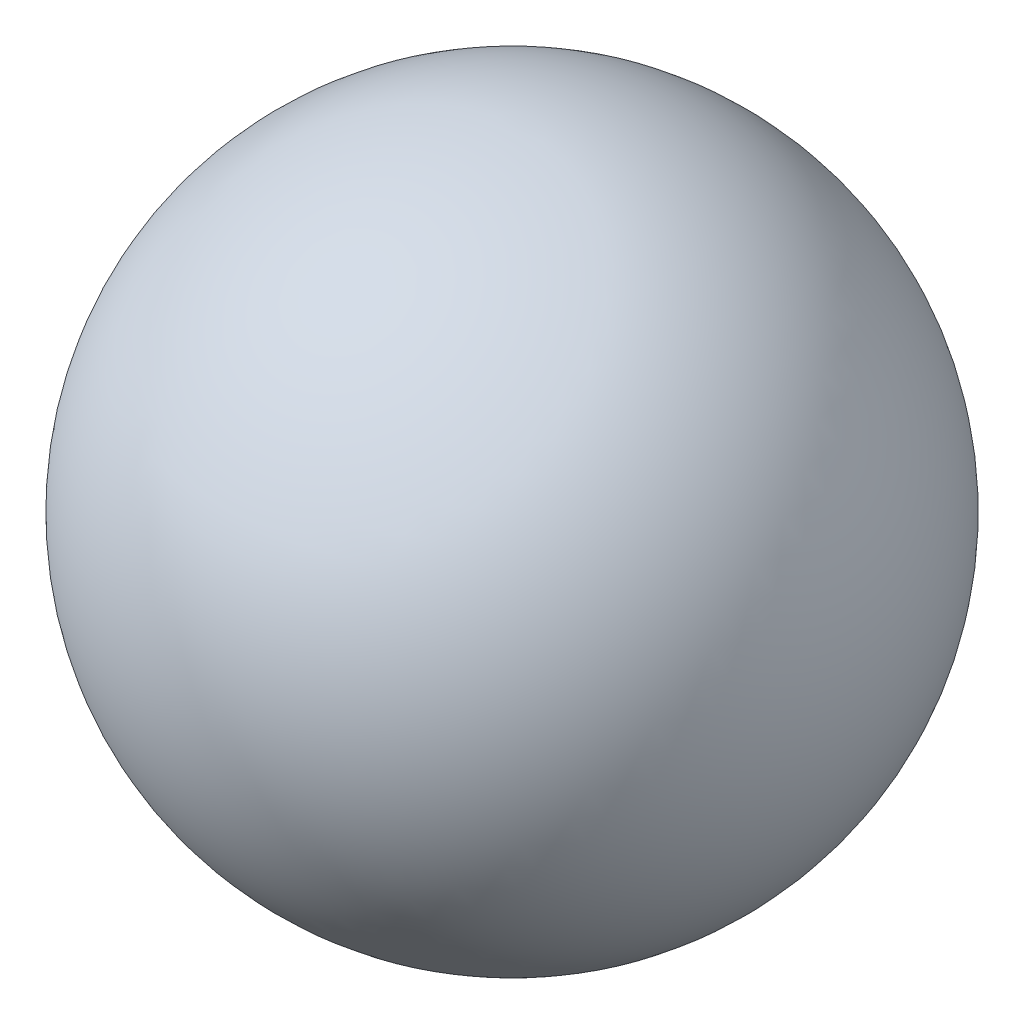
ISO-10303-21;
HEADER;
FILE_DESCRIPTION(('STEP AP214'),'2;1');
FILE_NAME('part.step','',(''),(''),'','','');
FILE_SCHEMA(('AUTOMOTIVE_DESIGN { 1 0 10303 214 1 1 1 1 }'));
ENDSEC;
DATA;
#1=APPLICATION_CONTEXT('core data for automotive mechanical design processes');
#2=APPLICATION_PROTOCOL_DEFINITION('international standard','automotive_design',2000,#1);
#3=PRODUCT_CONTEXT('',#1,'mechanical');
#4=PRODUCT('Part','Part','',(#3));
#5=PRODUCT_RELATED_PRODUCT_CATEGORY('part','',(#4));
#6=PRODUCT_DEFINITION_FORMATION('','',#4);
#7=PRODUCT_DEFINITION_CONTEXT('part definition',#1,'design');
#8=PRODUCT_DEFINITION('design','',#6,#7);
#9=PRODUCT_DEFINITION_SHAPE('','',#8);
#10=(LENGTH_UNIT() NAMED_UNIT(*) SI_UNIT(.MILLI.,.METRE.));
#11=(NAMED_UNIT(*) PLANE_ANGLE_UNIT() SI_UNIT($,.RADIAN.));
#12=(NAMED_UNIT(*) SI_UNIT($,.STERADIAN.) SOLID_ANGLE_UNIT());
#13=UNCERTAINTY_MEASURE_WITH_UNIT(LENGTH_MEASURE(1.E-05),#10,'distance_accuracy_value','');
#14=(GEOMETRIC_REPRESENTATION_CONTEXT(3) GLOBAL_UNCERTAINTY_ASSIGNED_CONTEXT((#13)) GLOBAL_UNIT_ASSIGNED_CONTEXT((#10,
#11,#12)) REPRESENTATION_CONTEXT('',''));
#15=CARTESIAN_POINT('',(0.,0.,0.));
#16=DIRECTION('',(0.,0.,1.));
#17=DIRECTION('',(1.,0.,0.));
#18=AXIS2_PLACEMENT_3D('',#15,#16,#17);
#19=CARTESIAN_POINT('',(-690.550000025001,787.4,0.));
#20=DIRECTION('',(0.,1.,0.));
#21=DIRECTION('',(1.,0.,0.));
#22=AXIS2_PLACEMENT_3D('',#19,#20,#21);
#23=SPHERICAL_SURFACE('',#22,149.999999974001);
#24=CARTESIAN_POINT('',(-690.550000025001,937.399999974001,0.));
#25=VERTEX_POINT('',#24);
#26=VERTEX_LOOP('',#25);
#27=FACE_BOUND('',#26,.T.);
#28=ADVANCED_FACE('F31',(#27),#23,.T.);
#29=CLOSED_SHELL('',(#28));
#30=MANIFOLD_SOLID_BREP('B2',#29);
#31=ADVANCED_BREP_SHAPE_REPRESENTATION('',(#18,#30),#14);
#32=SHAPE_DEFINITION_REPRESENTATION(#9,#31);
ENDSEC;
END-ISO-10303-21;
